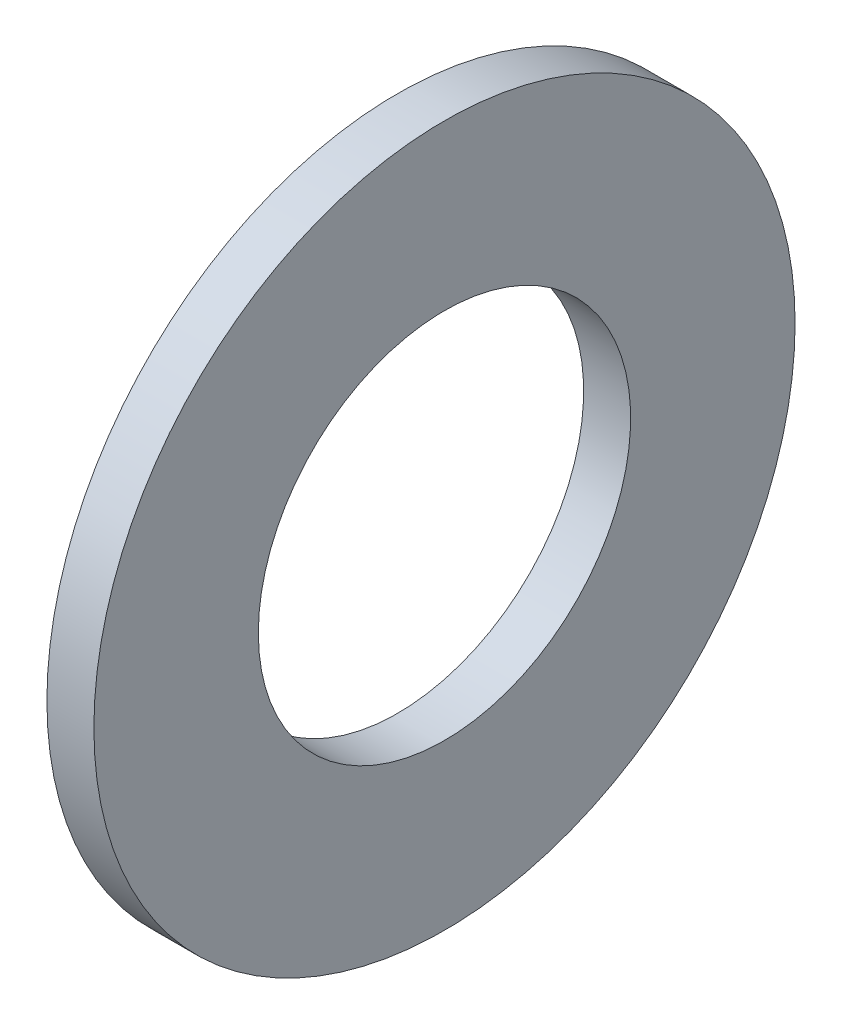
ISO-10303-21;
HEADER;
FILE_DESCRIPTION(('STEP AP214'),'2;1');
FILE_NAME('part.step','',(''),(''),'','','');
FILE_SCHEMA(('AUTOMOTIVE_DESIGN { 1 0 10303 214 1 1 1 1 }'));
ENDSEC;
DATA;
#1=APPLICATION_CONTEXT('core data for automotive mechanical design processes');
#2=APPLICATION_PROTOCOL_DEFINITION('international standard','automotive_design',2000,#1);
#3=PRODUCT_CONTEXT('',#1,'mechanical');
#4=PRODUCT('Part','Part','',(#3));
#5=PRODUCT_RELATED_PRODUCT_CATEGORY('part','',(#4));
#6=PRODUCT_DEFINITION_FORMATION('','',#4);
#7=PRODUCT_DEFINITION_CONTEXT('part definition',#1,'design');
#8=PRODUCT_DEFINITION('design','',#6,#7);
#9=PRODUCT_DEFINITION_SHAPE('','',#8);
#10=(LENGTH_UNIT() NAMED_UNIT(*) SI_UNIT(.MILLI.,.METRE.));
#11=(NAMED_UNIT(*) PLANE_ANGLE_UNIT() SI_UNIT($,.RADIAN.));
#12=(NAMED_UNIT(*) SI_UNIT($,.STERADIAN.) SOLID_ANGLE_UNIT());
#13=UNCERTAINTY_MEASURE_WITH_UNIT(LENGTH_MEASURE(1.E-05),#10,'distance_accuracy_value','');
#14=(GEOMETRIC_REPRESENTATION_CONTEXT(3) GLOBAL_UNCERTAINTY_ASSIGNED_CONTEXT((#13)) GLOBAL_UNIT_ASSIGNED_CONTEXT((#10,
#11,#12)) REPRESENTATION_CONTEXT('',''));
#15=CARTESIAN_POINT('',(0.,0.,0.));
#16=DIRECTION('',(0.,0.,1.));
#17=DIRECTION('',(1.,0.,0.));
#18=AXIS2_PLACEMENT_3D('',#15,#16,#17);
#19=CARTESIAN_POINT('',(-34.9249999999999,0.,0.));
#20=DIRECTION('',(-1.,0.,0.));
#21=DIRECTION('',(0.,0.,1.));
#22=AXIS2_PLACEMENT_3D('',#19,#20,#21);
#23=CYLINDRICAL_SURFACE('',#22,13.4874);
#24=CARTESIAN_POINT('',(0.,0.,0.));
#25=DIRECTION('',(-1.,0.,0.));
#26=DIRECTION('',(0.,0.,1.));
#27=AXIS2_PLACEMENT_3D('',#24,#25,#26);
#28=CIRCLE('',#27,13.4874);
#29=CARTESIAN_POINT('',(0.,0.,13.4874));
#30=VERTEX_POINT('',#29);
#31=EDGE_CURVE('E10',#30,#30,#28,.T.);
#32=ORIENTED_EDGE('',*,*,#31,.F.);
#33=EDGE_LOOP('',(#32));
#34=FACE_BOUND('',#33,.T.);
#35=CARTESIAN_POINT('',(-3.4036,0.,0.));
#36=DIRECTION('',(-1.,0.,0.));
#37=DIRECTION('',(0.,0.,1.));
#38=AXIS2_PLACEMENT_3D('',#35,#36,#37);
#39=CIRCLE('',#38,13.4874);
#40=CARTESIAN_POINT('',(-3.4036,0.,13.4874));
#41=VERTEX_POINT('',#40);
#42=EDGE_CURVE('E45',#41,#41,#39,.T.);
#43=ORIENTED_EDGE('',*,*,#42,.T.);
#44=EDGE_LOOP('',(#43));
#45=FACE_BOUND('',#44,.T.);
#46=ADVANCED_FACE('F31',(#34,#45),#23,.F.);
#47=CARTESIAN_POINT('',(0.,13.4874,0.));
#48=DIRECTION('',(-1.,0.,0.));
#49=DIRECTION('',(0.,0.,1.));
#50=AXIS2_PLACEMENT_3D('',#47,#48,#49);
#51=PLANE('',#50);
#52=CARTESIAN_POINT('',(0.,0.,0.));
#53=DIRECTION('',(-1.,0.,0.));
#54=DIRECTION('',(0.,0.,1.));
#55=AXIS2_PLACEMENT_3D('',#52,#53,#54);
#56=CIRCLE('',#55,25.4);
#57=CARTESIAN_POINT('',(0.,0.,25.4));
#58=VERTEX_POINT('',#57);
#59=EDGE_CURVE('E37',#58,#58,#56,.T.);
#60=ORIENTED_EDGE('',*,*,#59,.F.);
#61=EDGE_LOOP('',(#60));
#62=FACE_BOUND('',#61,.T.);
#63=ORIENTED_EDGE('',*,*,#31,.T.);
#64=EDGE_LOOP('',(#63));
#65=FACE_BOUND('',#64,.T.);
#66=ADVANCED_FACE('F60',(#62,#65),#51,.F.);
#67=CARTESIAN_POINT('',(-34.9249999999999,0.,0.));
#68=DIRECTION('',(-1.,0.,0.));
#69=DIRECTION('',(0.,0.,1.));
#70=AXIS2_PLACEMENT_3D('',#67,#68,#69);
#71=CYLINDRICAL_SURFACE('',#70,25.4);
#72=CARTESIAN_POINT('',(-3.4036,0.,0.));
#73=DIRECTION('',(-1.,0.,0.));
#74=DIRECTION('',(0.,0.,1.));
#75=AXIS2_PLACEMENT_3D('',#72,#73,#74);
#76=CIRCLE('',#75,25.4);
#77=CARTESIAN_POINT('',(-3.4036,0.,25.4));
#78=VERTEX_POINT('',#77);
#79=EDGE_CURVE('E41',#78,#78,#76,.T.);
#80=ORIENTED_EDGE('',*,*,#79,.F.);
#81=EDGE_LOOP('',(#80));
#82=FACE_BOUND('',#81,.T.);
#83=ORIENTED_EDGE('',*,*,#59,.T.);
#84=EDGE_LOOP('',(#83));
#85=FACE_BOUND('',#84,.T.);
#86=ADVANCED_FACE('F55',(#82,#85),#71,.T.);
#87=CARTESIAN_POINT('',(-3.4036,25.4,0.));
#88=DIRECTION('',(1.,0.,0.));
#89=DIRECTION('',(0.,0.,-1.));
#90=AXIS2_PLACEMENT_3D('',#87,#88,#89);
#91=PLANE('',#90);
#92=ORIENTED_EDGE('',*,*,#42,.F.);
#93=EDGE_LOOP('',(#92));
#94=FACE_BOUND('',#93,.T.);
#95=ORIENTED_EDGE('',*,*,#79,.T.);
#96=EDGE_LOOP('',(#95));
#97=FACE_BOUND('',#96,.T.);
#98=ADVANCED_FACE('F52',(#94,#97),#91,.F.);
#99=CLOSED_SHELL('',(#46,#66,#86,#98));
#100=MANIFOLD_SOLID_BREP('B2',#99);
#101=ADVANCED_BREP_SHAPE_REPRESENTATION('',(#18,#100),#14);
#102=SHAPE_DEFINITION_REPRESENTATION(#9,#101);
ENDSEC;
END-ISO-10303-21;
